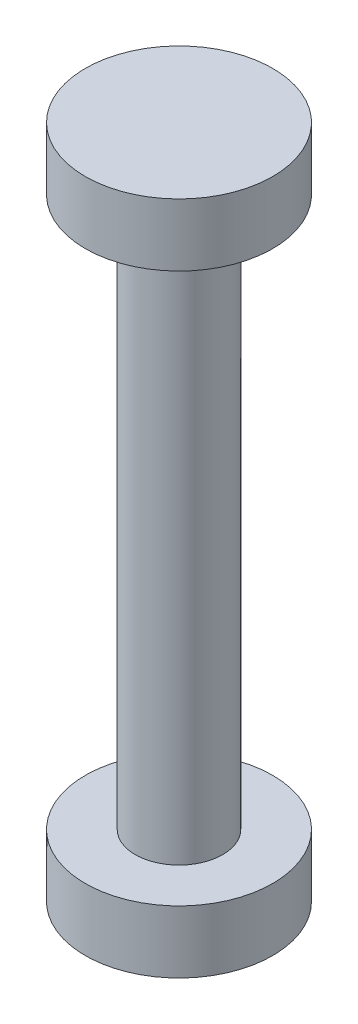
ISO-10303-21;
HEADER;
FILE_DESCRIPTION(('STEP AP214'),'2;1');
FILE_NAME('part.step','',(''),(''),'','','');
FILE_SCHEMA(('AUTOMOTIVE_DESIGN { 1 0 10303 214 1 1 1 1 }'));
ENDSEC;
DATA;
#1=APPLICATION_CONTEXT('core data for automotive mechanical design processes');
#2=APPLICATION_PROTOCOL_DEFINITION('international standard','automotive_design',2000,#1);
#3=PRODUCT_CONTEXT('',#1,'mechanical');
#4=PRODUCT('Part','Part','',(#3));
#5=PRODUCT_RELATED_PRODUCT_CATEGORY('part','',(#4));
#6=PRODUCT_DEFINITION_FORMATION('','',#4);
#7=PRODUCT_DEFINITION_CONTEXT('part definition',#1,'design');
#8=PRODUCT_DEFINITION('design','',#6,#7);
#9=PRODUCT_DEFINITION_SHAPE('','',#8);
#10=(LENGTH_UNIT() NAMED_UNIT(*) SI_UNIT(.MILLI.,.METRE.));
#11=(NAMED_UNIT(*) PLANE_ANGLE_UNIT() SI_UNIT($,.RADIAN.));
#12=(NAMED_UNIT(*) SI_UNIT($,.STERADIAN.) SOLID_ANGLE_UNIT());
#13=UNCERTAINTY_MEASURE_WITH_UNIT(LENGTH_MEASURE(1.E-05),#10,'distance_accuracy_value','');
#14=(GEOMETRIC_REPRESENTATION_CONTEXT(3) GLOBAL_UNCERTAINTY_ASSIGNED_CONTEXT((#13)) GLOBAL_UNIT_ASSIGNED_CONTEXT((#10,
#11,#12)) REPRESENTATION_CONTEXT('',''));
#15=CARTESIAN_POINT('',(0.,0.,0.));
#16=DIRECTION('',(0.,0.,1.));
#17=DIRECTION('',(1.,0.,0.));
#18=AXIS2_PLACEMENT_3D('',#15,#16,#17);
#19=CARTESIAN_POINT('',(0.,-108.,0.));
#20=DIRECTION('',(0.,1.,0.));
#21=DIRECTION('',(0.,0.,1.));
#22=AXIS2_PLACEMENT_3D('',#19,#20,#21);
#23=CYLINDRICAL_SURFACE('',#22,7.);
#24=CARTESIAN_POINT('',(0.,-10.,0.));
#25=DIRECTION('',(0.,-1.,0.));
#26=DIRECTION('',(0.,0.,-1.));
#27=AXIS2_PLACEMENT_3D('',#24,#25,#26);
#28=CIRCLE('',#27,7.);
#29=CARTESIAN_POINT('',(0.,-10.,-7.));
#30=VERTEX_POINT('',#29);
#31=EDGE_CURVE('E44',#30,#30,#28,.T.);
#32=ORIENTED_EDGE('',*,*,#31,.T.);
#33=EDGE_LOOP('',(#32));
#34=FACE_BOUND('',#33,.T.);
#35=CARTESIAN_POINT('',(0.,-98.,0.));
#36=DIRECTION('',(0.,-1.,0.));
#37=DIRECTION('',(0.,0.,-1.));
#38=AXIS2_PLACEMENT_3D('',#35,#36,#37);
#39=CIRCLE('',#38,7.);
#40=CARTESIAN_POINT('',(0.,-98.,-7.));
#41=VERTEX_POINT('',#40);
#42=EDGE_CURVE('E10',#41,#41,#39,.T.);
#43=ORIENTED_EDGE('',*,*,#42,.F.);
#44=EDGE_LOOP('',(#43));
#45=FACE_BOUND('',#44,.T.);
#46=ADVANCED_FACE('F37',(#34,#45),#23,.T.);
#47=CARTESIAN_POINT('',(0.,-10.,0.));
#48=DIRECTION('',(0.,1.,0.));
#49=DIRECTION('',(0.,0.,1.));
#50=AXIS2_PLACEMENT_3D('',#47,#48,#49);
#51=CYLINDRICAL_SURFACE('',#50,15.);
#52=CARTESIAN_POINT('',(0.,-10.,0.));
#53=DIRECTION('',(0.,1.,0.));
#54=DIRECTION('',(0.,0.,1.));
#55=AXIS2_PLACEMENT_3D('',#52,#53,#54);
#56=CIRCLE('',#55,15.);
#57=CARTESIAN_POINT('',(0.,-10.,15.));
#58=VERTEX_POINT('',#57);
#59=EDGE_CURVE('E48',#58,#58,#56,.T.);
#60=ORIENTED_EDGE('',*,*,#59,.T.);
#61=EDGE_LOOP('',(#60));
#62=FACE_BOUND('',#61,.T.);
#63=CARTESIAN_POINT('',(0.,0.,0.));
#64=DIRECTION('',(0.,1.,0.));
#65=DIRECTION('',(0.,0.,1.));
#66=AXIS2_PLACEMENT_3D('',#63,#64,#65);
#67=CIRCLE('',#66,15.);
#68=CARTESIAN_POINT('',(0.,0.,15.));
#69=VERTEX_POINT('',#68);
#70=EDGE_CURVE('E53',#69,#69,#67,.T.);
#71=ORIENTED_EDGE('',*,*,#70,.F.);
#72=EDGE_LOOP('',(#71));
#73=FACE_BOUND('',#72,.T.);
#74=ADVANCED_FACE('F39',(#62,#73),#51,.T.);
#75=CARTESIAN_POINT('',(0.,-10.,0.));
#76=DIRECTION('',(0.,1.,0.));
#77=DIRECTION('',(0.,0.,1.));
#78=AXIS2_PLACEMENT_3D('',#75,#76,#77);
#79=PLANE('',#78);
#80=ORIENTED_EDGE('',*,*,#31,.F.);
#81=EDGE_LOOP('',(#80));
#82=FACE_BOUND('',#81,.T.);
#83=ORIENTED_EDGE('',*,*,#59,.F.);
#84=EDGE_LOOP('',(#83));
#85=FACE_BOUND('',#84,.T.);
#86=ADVANCED_FACE('F80',(#82,#85),#79,.F.);
#87=CARTESIAN_POINT('',(0.,0.,0.));
#88=DIRECTION('',(0.,1.,0.));
#89=DIRECTION('',(0.,0.,1.));
#90=AXIS2_PLACEMENT_3D('',#87,#88,#89);
#91=PLANE('',#90);
#92=ORIENTED_EDGE('',*,*,#70,.T.);
#93=EDGE_LOOP('',(#92));
#94=FACE_BOUND('',#93,.T.);
#95=ADVANCED_FACE('F73',(#94),#91,.T.);
#96=CARTESIAN_POINT('',(0.,-98.,0.));
#97=DIRECTION('',(0.,-1.,0.));
#98=DIRECTION('',(0.,0.,-1.));
#99=AXIS2_PLACEMENT_3D('',#96,#97,#98);
#100=CYLINDRICAL_SURFACE('',#99,15.);
#101=CARTESIAN_POINT('',(0.,-98.,0.));
#102=DIRECTION('',(0.,-1.,0.));
#103=DIRECTION('',(0.,0.,-1.));
#104=AXIS2_PLACEMENT_3D('',#101,#102,#103);
#105=CIRCLE('',#104,15.);
#106=CARTESIAN_POINT('',(0.,-98.,-15.));
#107=VERTEX_POINT('',#106);
#108=EDGE_CURVE('E59',#107,#107,#105,.T.);
#109=ORIENTED_EDGE('',*,*,#108,.T.);
#110=EDGE_LOOP('',(#109));
#111=FACE_BOUND('',#110,.T.);
#112=CARTESIAN_POINT('',(0.,-108.,0.));
#113=DIRECTION('',(0.,-1.,0.));
#114=DIRECTION('',(0.,0.,-1.));
#115=AXIS2_PLACEMENT_3D('',#112,#113,#114);
#116=CIRCLE('',#115,15.);
#117=CARTESIAN_POINT('',(0.,-108.,-15.));
#118=VERTEX_POINT('',#117);
#119=EDGE_CURVE('E56',#118,#118,#116,.T.);
#120=ORIENTED_EDGE('',*,*,#119,.F.);
#121=EDGE_LOOP('',(#120));
#122=FACE_BOUND('',#121,.T.);
#123=ADVANCED_FACE('F70',(#111,#122),#100,.T.);
#124=CARTESIAN_POINT('',(0.,-98.,0.));
#125=DIRECTION('',(0.,-1.,0.));
#126=DIRECTION('',(0.,0.,-1.));
#127=AXIS2_PLACEMENT_3D('',#124,#125,#126);
#128=PLANE('',#127);
#129=ORIENTED_EDGE('',*,*,#42,.T.);
#130=EDGE_LOOP('',(#129));
#131=FACE_BOUND('',#130,.T.);
#132=ORIENTED_EDGE('',*,*,#108,.F.);
#133=EDGE_LOOP('',(#132));
#134=FACE_BOUND('',#133,.T.);
#135=ADVANCED_FACE('F72',(#131,#134),#128,.F.);
#136=CARTESIAN_POINT('',(0.,-108.,0.));
#137=DIRECTION('',(0.,-1.,0.));
#138=DIRECTION('',(0.,0.,-1.));
#139=AXIS2_PLACEMENT_3D('',#136,#137,#138);
#140=PLANE('',#139);
#141=ORIENTED_EDGE('',*,*,#119,.T.);
#142=EDGE_LOOP('',(#141));
#143=FACE_BOUND('',#142,.T.);
#144=ADVANCED_FACE('F68',(#143),#140,.T.);
#145=CLOSED_SHELL('',(#46,#74,#86,#95,#123,#135,#144));
#146=MANIFOLD_SOLID_BREP('B2',#145);
#147=ADVANCED_BREP_SHAPE_REPRESENTATION('',(#18,#146),#14);
#148=SHAPE_DEFINITION_REPRESENTATION(#9,#147);
ENDSEC;
END-ISO-10303-21;
